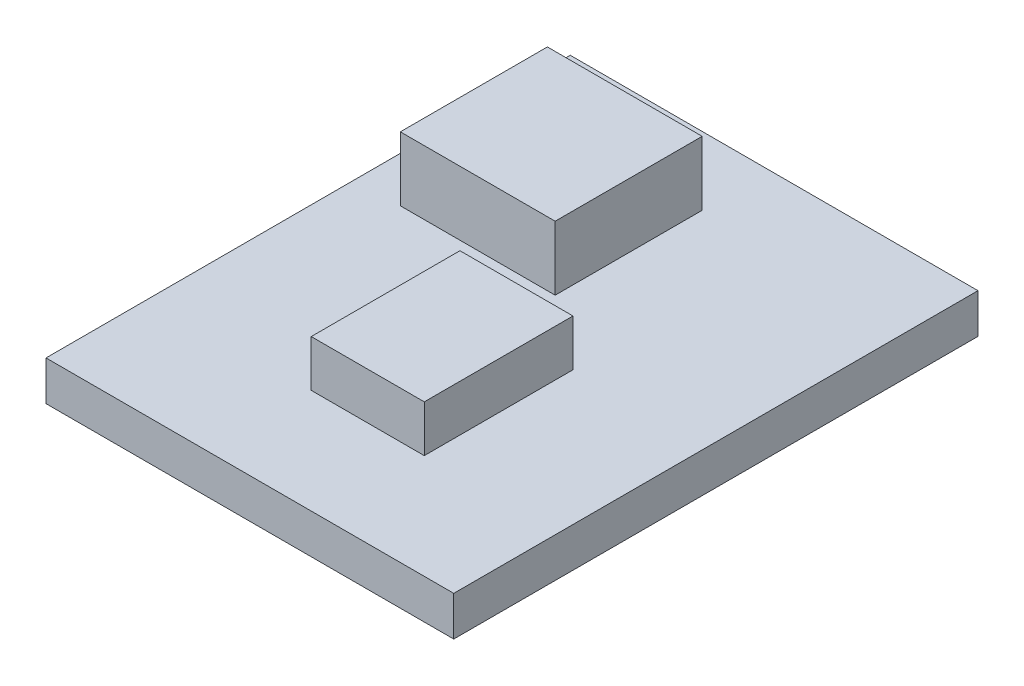
ISO-10303-21;
HEADER;
FILE_DESCRIPTION(('STEP AP214'),'2;1');
FILE_NAME('part.step','',(''),(''),'','','');
FILE_SCHEMA(('AUTOMOTIVE_DESIGN { 1 0 10303 214 1 1 1 1 }'));
ENDSEC;
DATA;
#1=APPLICATION_CONTEXT('core data for automotive mechanical design processes');
#2=APPLICATION_PROTOCOL_DEFINITION('international standard','automotive_design',2000,#1);
#3=PRODUCT_CONTEXT('',#1,'mechanical');
#4=PRODUCT('Part','Part','',(#3));
#5=PRODUCT_RELATED_PRODUCT_CATEGORY('part','',(#4));
#6=PRODUCT_DEFINITION_FORMATION('','',#4);
#7=PRODUCT_DEFINITION_CONTEXT('part definition',#1,'design');
#8=PRODUCT_DEFINITION('design','',#6,#7);
#9=PRODUCT_DEFINITION_SHAPE('','',#8);
#10=(LENGTH_UNIT() NAMED_UNIT(*) SI_UNIT(.MILLI.,.METRE.));
#11=(NAMED_UNIT(*) PLANE_ANGLE_UNIT() SI_UNIT($,.RADIAN.));
#12=(NAMED_UNIT(*) SI_UNIT($,.STERADIAN.) SOLID_ANGLE_UNIT());
#13=UNCERTAINTY_MEASURE_WITH_UNIT(LENGTH_MEASURE(1.E-05),#10,'distance_accuracy_value','');
#14=(GEOMETRIC_REPRESENTATION_CONTEXT(3) GLOBAL_UNCERTAINTY_ASSIGNED_CONTEXT((#13)) GLOBAL_UNIT_ASSIGNED_CONTEXT((#10,
#11,#12)) REPRESENTATION_CONTEXT('',''));
#15=CARTESIAN_POINT('',(0.,0.,0.));
#16=DIRECTION('',(0.,0.,1.));
#17=DIRECTION('',(1.,0.,0.));
#18=AXIS2_PLACEMENT_3D('',#15,#16,#17);
#19=CARTESIAN_POINT('',(0.,1.7,0.));
#20=DIRECTION('',(0.,1.,0.));
#21=DIRECTION('',(0.,0.,1.));
#22=AXIS2_PLACEMENT_3D('',#19,#20,#21);
#23=PLANE('',#22);
#24=DIRECTION('',(0.,0.,1.));
#25=VECTOR('',#24,1.);
#26=CARTESIAN_POINT('',(-7.74601063829785,1.7,0.));
#27=LINE('',#26,#25);
#28=CARTESIAN_POINT('',(-7.74601063829785,1.7,0.));
#29=VERTEX_POINT('',#28);
#30=CARTESIAN_POINT('',(-7.74601063829785,1.7,22.5));
#31=VERTEX_POINT('',#30);
#32=EDGE_CURVE('E180',#29,#31,#27,.T.);
#33=ORIENTED_EDGE('',*,*,#32,.T.);
#34=DIRECTION('',(1.,0.,0.));
#35=VECTOR('',#34,1.);
#36=CARTESIAN_POINT('',(-7.74601063829785,1.7,22.5));
#37=LINE('',#36,#35);
#38=CARTESIAN_POINT('',(9.75398936170215,1.7,22.5));
#39=VERTEX_POINT('',#38);
#40=EDGE_CURVE('E183',#31,#39,#37,.T.);
#41=ORIENTED_EDGE('',*,*,#40,.T.);
#42=DIRECTION('',(0.,0.,-1.));
#43=VECTOR('',#42,1.);
#44=CARTESIAN_POINT('',(9.75398936170215,1.7,0.));
#45=LINE('',#44,#43);
#46=CARTESIAN_POINT('',(9.75398936170215,1.7,0.));
#47=VERTEX_POINT('',#46);
#48=EDGE_CURVE('E186',#39,#47,#45,.T.);
#49=ORIENTED_EDGE('',*,*,#48,.T.);
#50=DIRECTION('',(-1.,0.,0.));
#51=VECTOR('',#50,1.);
#52=CARTESIAN_POINT('',(-7.74601063829785,1.7,0.));
#53=LINE('',#52,#51);
#54=EDGE_CURVE('E188',#47,#29,#53,.T.);
#55=ORIENTED_EDGE('',*,*,#54,.T.);
#56=EDGE_LOOP('',(#33,#41,#49,#55));
#57=FACE_BOUND('',#56,.T.);
#58=DIRECTION('',(1.,0.,0.));
#59=VECTOR('',#58,1.);
#60=CARTESIAN_POINT('',(-5.79635038899815,1.7,9.24216682228883));
#61=LINE('',#60,#59);
#62=CARTESIAN_POINT('',(-5.79635038899815,1.7,9.24216682228883));
#63=VERTEX_POINT('',#62);
#64=CARTESIAN_POINT('',(0.848621318188789,1.7,9.24216682228883));
#65=VERTEX_POINT('',#64);
#66=EDGE_CURVE('E151',#63,#65,#61,.T.);
#67=ORIENTED_EDGE('',*,*,#66,.F.);
#68=DIRECTION('',(0.,0.,1.));
#69=VECTOR('',#68,1.);
#70=CARTESIAN_POINT('',(-5.79635038899815,1.7,2.93183397805376));
#71=LINE('',#70,#69);
#72=CARTESIAN_POINT('',(-5.79635038899815,1.7,2.93183397805376));
#73=VERTEX_POINT('',#72);
#74=EDGE_CURVE('E148',#73,#63,#71,.T.);
#75=ORIENTED_EDGE('',*,*,#74,.F.);
#76=DIRECTION('',(-1.,0.,0.));
#77=VECTOR('',#76,1.);
#78=CARTESIAN_POINT('',(-5.79635038899815,1.7,2.93183397805376));
#79=LINE('',#78,#77);
#80=CARTESIAN_POINT('',(0.848621318188789,1.7,2.93183397805376));
#81=VERTEX_POINT('',#80);
#82=EDGE_CURVE('E160',#81,#73,#79,.T.);
#83=ORIENTED_EDGE('',*,*,#82,.F.);
#84=DIRECTION('',(0.,0.,-1.));
#85=VECTOR('',#84,1.);
#86=CARTESIAN_POINT('',(0.848621318188789,1.7,2.93183397805376));
#87=LINE('',#86,#85);
#88=EDGE_CURVE('E168',#65,#81,#87,.T.);
#89=ORIENTED_EDGE('',*,*,#88,.F.);
#90=EDGE_LOOP('',(#67,#75,#83,#89));
#91=FACE_BOUND('',#90,.T.);
#92=DIRECTION('',(1.,0.,0.));
#93=VECTOR('',#92,1.);
#94=CARTESIAN_POINT('',(-0.848475772495645,1.7,18.0144855868126));
#95=LINE('',#94,#93);
#96=CARTESIAN_POINT('',(-0.848475772495645,1.7,18.0144855868126));
#97=VERTEX_POINT('',#96);
#98=CARTESIAN_POINT('',(4.00378774030633,1.7,18.0144855868126));
#99=VERTEX_POINT('',#98);
#100=EDGE_CURVE('E369',#97,#99,#95,.T.);
#101=ORIENTED_EDGE('',*,*,#100,.F.);
#102=DIRECTION('',(0.,0.,1.));
#103=VECTOR('',#102,1.);
#104=CARTESIAN_POINT('',(-0.848475772495645,1.7,11.6324444148021));
#105=LINE('',#104,#103);
#106=CARTESIAN_POINT('',(-0.848475772495645,1.7,11.6324444148021));
#107=VERTEX_POINT('',#106);
#108=EDGE_CURVE('E146',#107,#97,#105,.T.);
#109=ORIENTED_EDGE('',*,*,#108,.F.);
#110=DIRECTION('',(-1.,0.,0.));
#111=VECTOR('',#110,1.);
#112=CARTESIAN_POINT('',(-0.848475772495645,1.7,11.6324444148021));
#113=LINE('',#112,#111);
#114=CARTESIAN_POINT('',(4.00378774030633,1.7,11.6324444148021));
#115=VERTEX_POINT('',#114);
#116=EDGE_CURVE('E142',#115,#107,#113,.T.);
#117=ORIENTED_EDGE('',*,*,#116,.F.);
#118=DIRECTION('',(0.,0.,-1.));
#119=VECTOR('',#118,1.);
#120=CARTESIAN_POINT('',(4.00378774030633,1.7,11.6324444148021));
#121=LINE('',#120,#119);
#122=EDGE_CURVE('E366',#99,#115,#121,.T.);
#123=ORIENTED_EDGE('',*,*,#122,.F.);
#124=EDGE_LOOP('',(#101,#109,#117,#123));
#125=FACE_BOUND('',#124,.T.);
#126=ADVANCED_FACE('F33',(#57,#91,#125),#23,.T.);
#127=CARTESIAN_POINT('',(-7.74601063829785,1.7,0.));
#128=DIRECTION('',(1.,0.,0.));
#129=DIRECTION('',(0.,0.,-1.));
#130=AXIS2_PLACEMENT_3D('',#127,#128,#129);
#131=PLANE('',#130);
#132=DIRECTION('',(0.,0.,1.));
#133=VECTOR('',#132,1.);
#134=CARTESIAN_POINT('',(-7.74601063829785,0.,0.));
#135=LINE('',#134,#133);
#136=CARTESIAN_POINT('',(-7.74601063829785,0.,0.));
#137=VERTEX_POINT('',#136);
#138=CARTESIAN_POINT('',(-7.74601063829785,0.,22.5));
#139=VERTEX_POINT('',#138);
#140=EDGE_CURVE('E179',#137,#139,#135,.T.);
#141=ORIENTED_EDGE('',*,*,#140,.T.);
#142=DIRECTION('',(0.,-1.,0.));
#143=VECTOR('',#142,1.);
#144=CARTESIAN_POINT('',(-7.74601063829785,1.7,22.5));
#145=LINE('',#144,#143);
#146=EDGE_CURVE('E11',#31,#139,#145,.T.);
#147=ORIENTED_EDGE('',*,*,#146,.F.);
#148=ORIENTED_EDGE('',*,*,#32,.F.);
#149=DIRECTION('',(0.,-1.,0.));
#150=VECTOR('',#149,1.);
#151=CARTESIAN_POINT('',(-7.74601063829785,1.7,0.));
#152=LINE('',#151,#150);
#153=EDGE_CURVE('E190',#29,#137,#152,.T.);
#154=ORIENTED_EDGE('',*,*,#153,.T.);
#155=EDGE_LOOP('',(#141,#147,#148,#154));
#156=FACE_BOUND('',#155,.T.);
#157=ADVANCED_FACE('F35',(#156),#131,.F.);
#158=CARTESIAN_POINT('',(-7.74601063829785,1.7,22.5));
#159=DIRECTION('',(0.,0.,-1.));
#160=DIRECTION('',(-1.,0.,0.));
#161=AXIS2_PLACEMENT_3D('',#158,#159,#160);
#162=PLANE('',#161);
#163=DIRECTION('',(1.,0.,0.));
#164=VECTOR('',#163,1.);
#165=CARTESIAN_POINT('',(-7.74601063829785,0.,22.5));
#166=LINE('',#165,#164);
#167=CARTESIAN_POINT('',(9.75398936170215,0.,22.5));
#168=VERTEX_POINT('',#167);
#169=EDGE_CURVE('E193',#139,#168,#166,.T.);
#170=ORIENTED_EDGE('',*,*,#169,.T.);
#171=DIRECTION('',(0.,-1.,0.));
#172=VECTOR('',#171,1.);
#173=CARTESIAN_POINT('',(9.75398936170215,1.7,22.5));
#174=LINE('',#173,#172);
#175=EDGE_CURVE('E41',#39,#168,#174,.T.);
#176=ORIENTED_EDGE('',*,*,#175,.F.);
#177=ORIENTED_EDGE('',*,*,#40,.F.);
#178=ORIENTED_EDGE('',*,*,#146,.T.);
#179=EDGE_LOOP('',(#170,#176,#177,#178));
#180=FACE_BOUND('',#179,.T.);
#181=ADVANCED_FACE('F223',(#180),#162,.F.);
#182=CARTESIAN_POINT('',(9.75398936170215,1.7,0.));
#183=DIRECTION('',(-1.,0.,0.));
#184=DIRECTION('',(0.,0.,1.));
#185=AXIS2_PLACEMENT_3D('',#182,#183,#184);
#186=PLANE('',#185);
#187=DIRECTION('',(0.,0.,-1.));
#188=VECTOR('',#187,1.);
#189=CARTESIAN_POINT('',(9.75398936170215,0.,0.));
#190=LINE('',#189,#188);
#191=CARTESIAN_POINT('',(9.75398936170215,0.,0.));
#192=VERTEX_POINT('',#191);
#193=EDGE_CURVE('E195',#168,#192,#190,.T.);
#194=ORIENTED_EDGE('',*,*,#193,.T.);
#195=DIRECTION('',(0.,-1.,0.));
#196=VECTOR('',#195,1.);
#197=CARTESIAN_POINT('',(9.75398936170215,1.7,0.));
#198=LINE('',#197,#196);
#199=EDGE_CURVE('E200',#47,#192,#198,.T.);
#200=ORIENTED_EDGE('',*,*,#199,.F.);
#201=ORIENTED_EDGE('',*,*,#48,.F.);
#202=ORIENTED_EDGE('',*,*,#175,.T.);
#203=EDGE_LOOP('',(#194,#200,#201,#202));
#204=FACE_BOUND('',#203,.T.);
#205=ADVANCED_FACE('F207',(#204),#186,.F.);
#206=CARTESIAN_POINT('',(-7.74601063829785,1.7,0.));
#207=DIRECTION('',(0.,0.,1.));
#208=DIRECTION('',(1.,0.,0.));
#209=AXIS2_PLACEMENT_3D('',#206,#207,#208);
#210=PLANE('',#209);
#211=DIRECTION('',(-1.,0.,0.));
#212=VECTOR('',#211,1.);
#213=CARTESIAN_POINT('',(-7.74601063829785,0.,0.));
#214=LINE('',#213,#212);
#215=EDGE_CURVE('E184',#192,#137,#214,.T.);
#216=ORIENTED_EDGE('',*,*,#215,.T.);
#217=ORIENTED_EDGE('',*,*,#153,.F.);
#218=ORIENTED_EDGE('',*,*,#54,.F.);
#219=ORIENTED_EDGE('',*,*,#199,.T.);
#220=EDGE_LOOP('',(#216,#217,#218,#219));
#221=FACE_BOUND('',#220,.T.);
#222=ADVANCED_FACE('F216',(#221),#210,.F.);
#223=CARTESIAN_POINT('',(0.,0.,0.));
#224=DIRECTION('',(0.,1.,0.));
#225=DIRECTION('',(0.,0.,1.));
#226=AXIS2_PLACEMENT_3D('',#223,#224,#225);
#227=PLANE('',#226);
#228=ORIENTED_EDGE('',*,*,#140,.F.);
#229=ORIENTED_EDGE('',*,*,#215,.F.);
#230=ORIENTED_EDGE('',*,*,#193,.F.);
#231=ORIENTED_EDGE('',*,*,#169,.F.);
#232=EDGE_LOOP('',(#228,#229,#230,#231));
#233=FACE_BOUND('',#232,.T.);
#234=ADVANCED_FACE('F213',(#233),#227,.F.);
#235=CARTESIAN_POINT('',(-5.79635038899815,4.45,2.93183397805376));
#236=DIRECTION('',(1.,0.,0.));
#237=DIRECTION('',(0.,0.,-1.));
#238=AXIS2_PLACEMENT_3D('',#235,#236,#237);
#239=PLANE('',#238);
#240=ORIENTED_EDGE('',*,*,#74,.T.);
#241=DIRECTION('',(0.,-1.,0.));
#242=VECTOR('',#241,1.);
#243=CARTESIAN_POINT('',(-5.79635038899815,4.45,9.24216682228883));
#244=LINE('',#243,#242);
#245=CARTESIAN_POINT('',(-5.79635038899815,4.45,9.24216682228883));
#246=VERTEX_POINT('',#245);
#247=EDGE_CURVE('E177',#246,#63,#244,.T.);
#248=ORIENTED_EDGE('',*,*,#247,.F.);
#249=DIRECTION('',(0.,0.,1.));
#250=VECTOR('',#249,1.);
#251=CARTESIAN_POINT('',(-5.79635038899815,4.45,2.93183397805376));
#252=LINE('',#251,#250);
#253=CARTESIAN_POINT('',(-5.79635038899815,4.45,2.93183397805376));
#254=VERTEX_POINT('',#253);
#255=EDGE_CURVE('E156',#254,#246,#252,.T.);
#256=ORIENTED_EDGE('',*,*,#255,.F.);
#257=DIRECTION('',(0.,-1.,0.));
#258=VECTOR('',#257,1.);
#259=CARTESIAN_POINT('',(-5.79635038899815,4.45,2.93183397805376));
#260=LINE('',#259,#258);
#261=EDGE_CURVE('E165',#254,#73,#260,.T.);
#262=ORIENTED_EDGE('',*,*,#261,.T.);
#263=EDGE_LOOP('',(#240,#248,#256,#262));
#264=FACE_BOUND('',#263,.T.);
#265=ADVANCED_FACE('F236',(#264),#239,.F.);
#266=CARTESIAN_POINT('',(-5.79635038899815,4.45,9.24216682228883));
#267=DIRECTION('',(0.,0.,-1.));
#268=DIRECTION('',(-1.,0.,0.));
#269=AXIS2_PLACEMENT_3D('',#266,#267,#268);
#270=PLANE('',#269);
#271=ORIENTED_EDGE('',*,*,#66,.T.);
#272=DIRECTION('',(0.,-1.,0.));
#273=VECTOR('',#272,1.);
#274=CARTESIAN_POINT('',(0.848621318188789,4.45,9.24216682228883));
#275=LINE('',#274,#273);
#276=CARTESIAN_POINT('',(0.848621318188789,4.45,9.24216682228883));
#277=VERTEX_POINT('',#276);
#278=EDGE_CURVE('E174',#277,#65,#275,.T.);
#279=ORIENTED_EDGE('',*,*,#278,.F.);
#280=DIRECTION('',(1.,0.,0.));
#281=VECTOR('',#280,1.);
#282=CARTESIAN_POINT('',(-5.79635038899815,4.45,9.24216682228883));
#283=LINE('',#282,#281);
#284=EDGE_CURVE('E159',#246,#277,#283,.T.);
#285=ORIENTED_EDGE('',*,*,#284,.F.);
#286=ORIENTED_EDGE('',*,*,#247,.T.);
#287=EDGE_LOOP('',(#271,#279,#285,#286));
#288=FACE_BOUND('',#287,.T.);
#289=ADVANCED_FACE('F255',(#288),#270,.F.);
#290=CARTESIAN_POINT('',(0.848621318188789,4.45,2.93183397805376));
#291=DIRECTION('',(-1.,0.,0.));
#292=DIRECTION('',(0.,0.,1.));
#293=AXIS2_PLACEMENT_3D('',#290,#291,#292);
#294=PLANE('',#293);
#295=ORIENTED_EDGE('',*,*,#88,.T.);
#296=DIRECTION('',(0.,-1.,0.));
#297=VECTOR('',#296,1.);
#298=CARTESIAN_POINT('',(0.848621318188789,4.45,2.93183397805376));
#299=LINE('',#298,#297);
#300=CARTESIAN_POINT('',(0.848621318188789,4.45,2.93183397805376));
#301=VERTEX_POINT('',#300);
#302=EDGE_CURVE('E56',#301,#81,#299,.T.);
#303=ORIENTED_EDGE('',*,*,#302,.F.);
#304=DIRECTION('',(0.,0.,-1.));
#305=VECTOR('',#304,1.);
#306=CARTESIAN_POINT('',(0.848621318188789,4.45,2.93183397805376));
#307=LINE('',#306,#305);
#308=EDGE_CURVE('E162',#277,#301,#307,.T.);
#309=ORIENTED_EDGE('',*,*,#308,.F.);
#310=ORIENTED_EDGE('',*,*,#278,.T.);
#311=EDGE_LOOP('',(#295,#303,#309,#310));
#312=FACE_BOUND('',#311,.T.);
#313=ADVANCED_FACE('F262',(#312),#294,.F.);
#314=CARTESIAN_POINT('',(-5.79635038899815,4.45,2.93183397805376));
#315=DIRECTION('',(0.,0.,1.));
#316=DIRECTION('',(1.,0.,0.));
#317=AXIS2_PLACEMENT_3D('',#314,#315,#316);
#318=PLANE('',#317);
#319=ORIENTED_EDGE('',*,*,#82,.T.);
#320=ORIENTED_EDGE('',*,*,#261,.F.);
#321=DIRECTION('',(-1.,0.,0.));
#322=VECTOR('',#321,1.);
#323=CARTESIAN_POINT('',(-5.79635038899815,4.45,2.93183397805376));
#324=LINE('',#323,#322);
#325=EDGE_CURVE('E164',#301,#254,#324,.T.);
#326=ORIENTED_EDGE('',*,*,#325,.F.);
#327=ORIENTED_EDGE('',*,*,#302,.T.);
#328=EDGE_LOOP('',(#319,#320,#326,#327));
#329=FACE_BOUND('',#328,.T.);
#330=ADVANCED_FACE('F269',(#329),#318,.F.);
#331=CARTESIAN_POINT('',(0.,4.45,0.));
#332=DIRECTION('',(0.,1.,0.));
#333=DIRECTION('',(0.,0.,1.));
#334=AXIS2_PLACEMENT_3D('',#331,#332,#333);
#335=PLANE('',#334);
#336=ORIENTED_EDGE('',*,*,#255,.T.);
#337=ORIENTED_EDGE('',*,*,#284,.T.);
#338=ORIENTED_EDGE('',*,*,#308,.T.);
#339=ORIENTED_EDGE('',*,*,#325,.T.);
#340=EDGE_LOOP('',(#336,#337,#338,#339));
#341=FACE_BOUND('',#340,.T.);
#342=ADVANCED_FACE('F277',(#341),#335,.T.);
#343=CARTESIAN_POINT('',(-0.848475772495645,3.7,11.6324444148021));
#344=DIRECTION('',(1.,0.,0.));
#345=DIRECTION('',(0.,0.,-1.));
#346=AXIS2_PLACEMENT_3D('',#343,#344,#345);
#347=PLANE('',#346);
#348=ORIENTED_EDGE('',*,*,#108,.T.);
#349=DIRECTION('',(0.,-1.,0.));
#350=VECTOR('',#349,1.);
#351=CARTESIAN_POINT('',(-0.848475772495645,3.7,18.0144855868126));
#352=LINE('',#351,#350);
#353=CARTESIAN_POINT('',(-0.848475772495645,3.7,18.0144855868126));
#354=VERTEX_POINT('',#353);
#355=EDGE_CURVE('E127',#354,#97,#352,.T.);
#356=ORIENTED_EDGE('',*,*,#355,.F.);
#357=DIRECTION('',(0.,0.,1.));
#358=VECTOR('',#357,1.);
#359=CARTESIAN_POINT('',(-0.848475772495645,3.7,11.6324444148021));
#360=LINE('',#359,#358);
#361=CARTESIAN_POINT('',(-0.848475772495645,3.7,11.6324444148021));
#362=VERTEX_POINT('',#361);
#363=EDGE_CURVE('E134',#362,#354,#360,.T.);
#364=ORIENTED_EDGE('',*,*,#363,.F.);
#365=DIRECTION('',(0.,-1.,0.));
#366=VECTOR('',#365,1.);
#367=CARTESIAN_POINT('',(-0.848475772495645,3.7,11.6324444148021));
#368=LINE('',#367,#366);
#369=EDGE_CURVE('E363',#362,#107,#368,.T.);
#370=ORIENTED_EDGE('',*,*,#369,.T.);
#371=EDGE_LOOP('',(#348,#356,#364,#370));
#372=FACE_BOUND('',#371,.T.);
#373=ADVANCED_FACE('F144',(#372),#347,.F.);
#374=CARTESIAN_POINT('',(-0.848475772495645,3.7,18.0144855868126));
#375=DIRECTION('',(0.,0.,-1.));
#376=DIRECTION('',(-1.,0.,0.));
#377=AXIS2_PLACEMENT_3D('',#374,#375,#376);
#378=PLANE('',#377);
#379=ORIENTED_EDGE('',*,*,#100,.T.);
#380=DIRECTION('',(0.,-1.,0.));
#381=VECTOR('',#380,1.);
#382=CARTESIAN_POINT('',(4.00378774030633,3.7,18.0144855868126));
#383=LINE('',#382,#381);
#384=CARTESIAN_POINT('',(4.00378774030633,3.7,18.0144855868126));
#385=VERTEX_POINT('',#384);
#386=EDGE_CURVE('E130',#385,#99,#383,.T.);
#387=ORIENTED_EDGE('',*,*,#386,.F.);
#388=DIRECTION('',(1.,0.,0.));
#389=VECTOR('',#388,1.);
#390=CARTESIAN_POINT('',(-0.848475772495645,3.7,18.0144855868126));
#391=LINE('',#390,#389);
#392=EDGE_CURVE('E123',#354,#385,#391,.T.);
#393=ORIENTED_EDGE('',*,*,#392,.F.);
#394=ORIENTED_EDGE('',*,*,#355,.T.);
#395=EDGE_LOOP('',(#379,#387,#393,#394));
#396=FACE_BOUND('',#395,.T.);
#397=ADVANCED_FACE('F125',(#396),#378,.F.);
#398=CARTESIAN_POINT('',(4.00378774030633,3.7,11.6324444148021));
#399=DIRECTION('',(-1.,0.,0.));
#400=DIRECTION('',(0.,0.,1.));
#401=AXIS2_PLACEMENT_3D('',#398,#399,#400);
#402=PLANE('',#401);
#403=ORIENTED_EDGE('',*,*,#122,.T.);
#404=DIRECTION('',(0.,-1.,0.));
#405=VECTOR('',#404,1.);
#406=CARTESIAN_POINT('',(4.00378774030633,3.7,11.6324444148021));
#407=LINE('',#406,#405);
#408=CARTESIAN_POINT('',(4.00378774030633,3.7,11.6324444148021));
#409=VERTEX_POINT('',#408);
#410=EDGE_CURVE('E48',#409,#115,#407,.T.);
#411=ORIENTED_EDGE('',*,*,#410,.F.);
#412=DIRECTION('',(0.,0.,-1.));
#413=VECTOR('',#412,1.);
#414=CARTESIAN_POINT('',(4.00378774030633,3.7,11.6324444148021));
#415=LINE('',#414,#413);
#416=EDGE_CURVE('E133',#385,#409,#415,.T.);
#417=ORIENTED_EDGE('',*,*,#416,.F.);
#418=ORIENTED_EDGE('',*,*,#386,.T.);
#419=EDGE_LOOP('',(#403,#411,#417,#418));
#420=FACE_BOUND('',#419,.T.);
#421=ADVANCED_FACE('F297',(#420),#402,.F.);
#422=CARTESIAN_POINT('',(-0.848475772495645,3.7,11.6324444148021));
#423=DIRECTION('',(0.,0.,1.));
#424=DIRECTION('',(1.,0.,0.));
#425=AXIS2_PLACEMENT_3D('',#422,#423,#424);
#426=PLANE('',#425);
#427=ORIENTED_EDGE('',*,*,#116,.T.);
#428=ORIENTED_EDGE('',*,*,#369,.F.);
#429=DIRECTION('',(-1.,0.,0.));
#430=VECTOR('',#429,1.);
#431=CARTESIAN_POINT('',(-0.848475772495645,3.7,11.6324444148021));
#432=LINE('',#431,#430);
#433=EDGE_CURVE('E138',#409,#362,#432,.T.);
#434=ORIENTED_EDGE('',*,*,#433,.F.);
#435=ORIENTED_EDGE('',*,*,#410,.T.);
#436=EDGE_LOOP('',(#427,#428,#434,#435));
#437=FACE_BOUND('',#436,.T.);
#438=ADVANCED_FACE('F304',(#437),#426,.F.);
#439=CARTESIAN_POINT('',(0.,3.7,0.));
#440=DIRECTION('',(0.,1.,0.));
#441=DIRECTION('',(0.,0.,1.));
#442=AXIS2_PLACEMENT_3D('',#439,#440,#441);
#443=PLANE('',#442);
#444=ORIENTED_EDGE('',*,*,#363,.T.);
#445=ORIENTED_EDGE('',*,*,#392,.T.);
#446=ORIENTED_EDGE('',*,*,#416,.T.);
#447=ORIENTED_EDGE('',*,*,#433,.T.);
#448=EDGE_LOOP('',(#444,#445,#446,#447));
#449=FACE_BOUND('',#448,.T.);
#450=ADVANCED_FACE('F137',(#449),#443,.T.);
#451=CLOSED_SHELL('',(#126,#157,#181,#205,#222,#234,#265,#289,#313,#330,#342,#373,#397,#421,
#438,#450));
#452=MANIFOLD_SOLID_BREP('B2',#451);
#453=ADVANCED_BREP_SHAPE_REPRESENTATION('',(#18,#452),#14);
#454=SHAPE_DEFINITION_REPRESENTATION(#9,#453);
ENDSEC;
END-ISO-10303-21;
